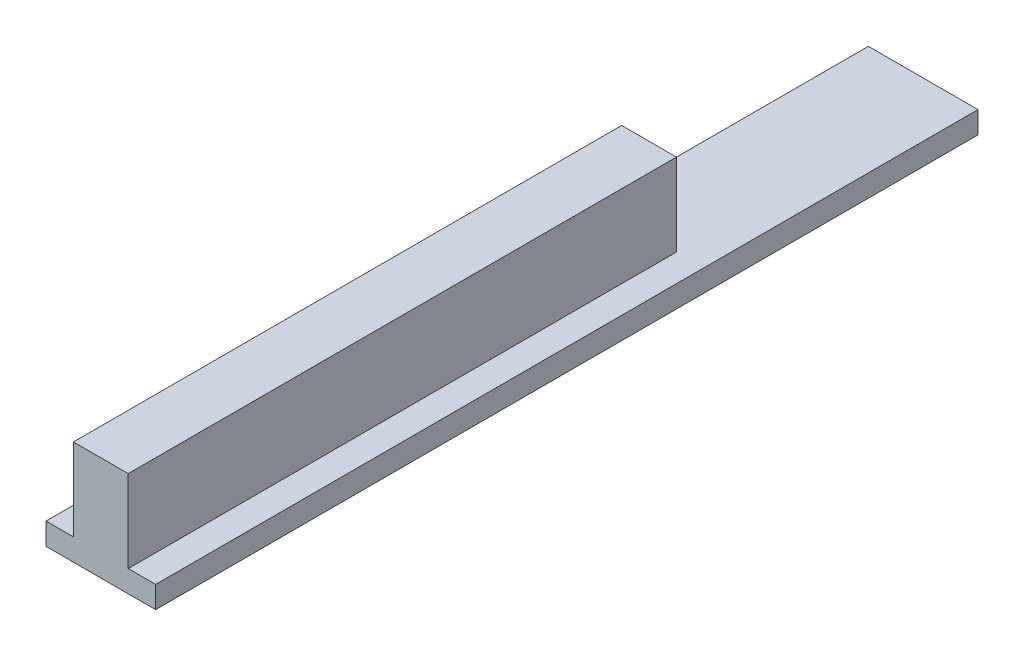
ISO-10303-21;
HEADER;
FILE_DESCRIPTION(('STEP AP214'),'2;1');
FILE_NAME('part.step','',(''),(''),'','','');
FILE_SCHEMA(('AUTOMOTIVE_DESIGN { 1 0 10303 214 1 1 1 1 }'));
ENDSEC;
DATA;
#1=APPLICATION_CONTEXT('core data for automotive mechanical design processes');
#2=APPLICATION_PROTOCOL_DEFINITION('international standard','automotive_design',2000,#1);
#3=PRODUCT_CONTEXT('',#1,'mechanical');
#4=PRODUCT('Part','Part','',(#3));
#5=PRODUCT_RELATED_PRODUCT_CATEGORY('part','',(#4));
#6=PRODUCT_DEFINITION_FORMATION('','',#4);
#7=PRODUCT_DEFINITION_CONTEXT('part definition',#1,'design');
#8=PRODUCT_DEFINITION('design','',#6,#7);
#9=PRODUCT_DEFINITION_SHAPE('','',#8);
#10=(LENGTH_UNIT() NAMED_UNIT(*) SI_UNIT(.MILLI.,.METRE.));
#11=(NAMED_UNIT(*) PLANE_ANGLE_UNIT() SI_UNIT($,.RADIAN.));
#12=(NAMED_UNIT(*) SI_UNIT($,.STERADIAN.) SOLID_ANGLE_UNIT());
#13=UNCERTAINTY_MEASURE_WITH_UNIT(LENGTH_MEASURE(1.E-05),#10,'distance_accuracy_value','');
#14=(GEOMETRIC_REPRESENTATION_CONTEXT(3) GLOBAL_UNCERTAINTY_ASSIGNED_CONTEXT((#13)) GLOBAL_UNIT_ASSIGNED_CONTEXT((#10,
#11,#12)) REPRESENTATION_CONTEXT('',''));
#15=CARTESIAN_POINT('',(0.,0.,0.));
#16=DIRECTION('',(0.,0.,1.));
#17=DIRECTION('',(1.,0.,0.));
#18=AXIS2_PLACEMENT_3D('',#15,#16,#17);
#19=CARTESIAN_POINT('',(5.00000000000006,0.,100.));
#20=DIRECTION('',(-1.,0.,0.));
#21=DIRECTION('',(0.,-1.,0.));
#22=AXIS2_PLACEMENT_3D('',#19,#20,#21);
#23=PLANE('',#22);
#24=DIRECTION('',(0.,1.,0.));
#25=VECTOR('',#24,1.);
#26=CARTESIAN_POINT('',(5.00000000000006,0.,0.));
#27=LINE('',#26,#25);
#28=CARTESIAN_POINT('',(5.00000000000006,4.,0.));
#29=VERTEX_POINT('',#28);
#30=CARTESIAN_POINT('',(5.00000000000006,19.,0.));
#31=VERTEX_POINT('',#30);
#32=EDGE_CURVE('E70',#29,#31,#27,.T.);
#33=ORIENTED_EDGE('',*,*,#32,.T.);
#34=DIRECTION('',(0.,0.,-1.));
#35=VECTOR('',#34,1.);
#36=CARTESIAN_POINT('',(5.00000000000006,19.,100.));
#37=LINE('',#36,#35);
#38=CARTESIAN_POINT('',(5.00000000000006,19.,100.));
#39=VERTEX_POINT('',#38);
#40=EDGE_CURVE('E158',#39,#31,#37,.T.);
#41=ORIENTED_EDGE('',*,*,#40,.F.);
#42=DIRECTION('',(0.,1.,0.));
#43=VECTOR('',#42,1.);
#44=CARTESIAN_POINT('',(5.00000000000006,0.,100.));
#45=LINE('',#44,#43);
#46=CARTESIAN_POINT('',(5.00000000000006,4.,100.));
#47=VERTEX_POINT('',#46);
#48=EDGE_CURVE('E165',#47,#39,#45,.T.);
#49=ORIENTED_EDGE('',*,*,#48,.F.);
#50=DIRECTION('',(0.,0.,-1.));
#51=VECTOR('',#50,1.);
#52=CARTESIAN_POINT('',(5.00000000000006,4.,100.));
#53=LINE('',#52,#51);
#54=EDGE_CURVE('E42',#47,#29,#53,.T.);
#55=ORIENTED_EDGE('',*,*,#54,.T.);
#56=EDGE_LOOP('',(#33,#41,#49,#55));
#57=FACE_BOUND('',#56,.T.);
#58=ADVANCED_FACE('F39',(#57),#23,.F.);
#59=CARTESIAN_POINT('',(0.,19.,100.));
#60=DIRECTION('',(0.,-1.,0.));
#61=DIRECTION('',(1.,0.,0.));
#62=AXIS2_PLACEMENT_3D('',#59,#60,#61);
#63=PLANE('',#62);
#64=DIRECTION('',(-1.,0.,0.));
#65=VECTOR('',#64,1.);
#66=CARTESIAN_POINT('',(0.,19.,0.));
#67=LINE('',#66,#65);
#68=CARTESIAN_POINT('',(-5.0000000000001,19.,0.));
#69=VERTEX_POINT('',#68);
#70=EDGE_CURVE('E137',#31,#69,#67,.T.);
#71=ORIENTED_EDGE('',*,*,#70,.T.);
#72=DIRECTION('',(0.,0.,-1.));
#73=VECTOR('',#72,1.);
#74=CARTESIAN_POINT('',(-5.0000000000001,19.,100.));
#75=LINE('',#74,#73);
#76=CARTESIAN_POINT('',(-5.0000000000001,19.,100.));
#77=VERTEX_POINT('',#76);
#78=EDGE_CURVE('E156',#77,#69,#75,.T.);
#79=ORIENTED_EDGE('',*,*,#78,.F.);
#80=DIRECTION('',(-1.,0.,0.));
#81=VECTOR('',#80,1.);
#82=CARTESIAN_POINT('',(0.,19.,100.));
#83=LINE('',#82,#81);
#84=EDGE_CURVE('E174',#39,#77,#83,.T.);
#85=ORIENTED_EDGE('',*,*,#84,.F.);
#86=ORIENTED_EDGE('',*,*,#40,.T.);
#87=EDGE_LOOP('',(#71,#79,#85,#86));
#88=FACE_BOUND('',#87,.T.);
#89=ADVANCED_FACE('F172',(#88),#63,.F.);
#90=CARTESIAN_POINT('',(-5.00000000000003,0.,100.));
#91=DIRECTION('',(-1.,0.,0.));
#92=DIRECTION('',(0.,-1.,0.));
#93=AXIS2_PLACEMENT_3D('',#90,#91,#92);
#94=PLANE('',#93);
#95=DIRECTION('',(0.,1.,0.));
#96=VECTOR('',#95,1.);
#97=CARTESIAN_POINT('',(-5.00000000000003,0.,0.));
#98=LINE('',#97,#96);
#99=CARTESIAN_POINT('',(-5.00000000000006,4.,0.));
#100=VERTEX_POINT('',#99);
#101=EDGE_CURVE('E142',#100,#69,#98,.T.);
#102=ORIENTED_EDGE('',*,*,#101,.F.);
#103=DIRECTION('',(0.,0.,-1.));
#104=VECTOR('',#103,1.);
#105=CARTESIAN_POINT('',(-5.00000000000006,4.,100.));
#106=LINE('',#105,#104);
#107=CARTESIAN_POINT('',(-5.00000000000006,4.,100.));
#108=VERTEX_POINT('',#107);
#109=EDGE_CURVE('E153',#108,#100,#106,.T.);
#110=ORIENTED_EDGE('',*,*,#109,.F.);
#111=DIRECTION('',(0.,1.,0.));
#112=VECTOR('',#111,1.);
#113=CARTESIAN_POINT('',(-5.00000000000003,0.,100.));
#114=LINE('',#113,#112);
#115=EDGE_CURVE('E176',#108,#77,#114,.T.);
#116=ORIENTED_EDGE('',*,*,#115,.T.);
#117=ORIENTED_EDGE('',*,*,#78,.T.);
#118=EDGE_LOOP('',(#102,#110,#116,#117));
#119=FACE_BOUND('',#118,.T.);
#120=ADVANCED_FACE('F177',(#119),#94,.T.);
#121=CARTESIAN_POINT('',(0.,4.,100.));
#122=DIRECTION('',(0.,-1.,0.));
#123=DIRECTION('',(0.,0.,-1.));
#124=AXIS2_PLACEMENT_3D('',#121,#122,#123);
#125=PLANE('',#124);
#126=ORIENTED_EDGE('',*,*,#109,.T.);
#127=DIRECTION('',(-1.,0.,0.));
#128=VECTOR('',#127,1.);
#129=CARTESIAN_POINT('',(0.,4.,0.));
#130=LINE('',#129,#128);
#131=EDGE_CURVE('E11',#29,#100,#130,.T.);
#132=ORIENTED_EDGE('',*,*,#131,.F.);
#133=ORIENTED_EDGE('',*,*,#54,.F.);
#134=DIRECTION('',(-1.,0.,0.));
#135=VECTOR('',#134,1.);
#136=CARTESIAN_POINT('',(0.,4.,100.));
#137=LINE('',#136,#135);
#138=CARTESIAN_POINT('',(10.0000000000001,4.,100.));
#139=VERTEX_POINT('',#138);
#140=EDGE_CURVE('E145',#139,#47,#137,.T.);
#141=ORIENTED_EDGE('',*,*,#140,.F.);
#142=DIRECTION('',(0.,0.,-1.));
#143=VECTOR('',#142,1.);
#144=CARTESIAN_POINT('',(10.0000000000001,4.,100.));
#145=LINE('',#144,#143);
#146=CARTESIAN_POINT('',(10.0000000000001,4.,-50.));
#147=VERTEX_POINT('',#146);
#148=EDGE_CURVE('E131',#139,#147,#145,.T.);
#149=ORIENTED_EDGE('',*,*,#148,.T.);
#150=DIRECTION('',(-1.,0.,0.));
#151=VECTOR('',#150,1.);
#152=CARTESIAN_POINT('',(0.,4.,-50.));
#153=LINE('',#152,#151);
#154=CARTESIAN_POINT('',(-10.0000000000001,4.,-50.));
#155=VERTEX_POINT('',#154);
#156=EDGE_CURVE('E195',#147,#155,#153,.T.);
#157=ORIENTED_EDGE('',*,*,#156,.T.);
#158=DIRECTION('',(0.,0.,-1.));
#159=VECTOR('',#158,1.);
#160=CARTESIAN_POINT('',(-10.0000000000001,4.,100.));
#161=LINE('',#160,#159);
#162=CARTESIAN_POINT('',(-10.0000000000001,4.,100.));
#163=VERTEX_POINT('',#162);
#164=EDGE_CURVE('E115',#163,#155,#161,.T.);
#165=ORIENTED_EDGE('',*,*,#164,.F.);
#166=EDGE_CURVE('E122',#108,#163,#137,.T.);
#167=ORIENTED_EDGE('',*,*,#166,.F.);
#168=EDGE_LOOP('',(#126,#132,#133,#141,#149,#157,#165,#167));
#169=FACE_BOUND('',#168,.T.);
#170=ADVANCED_FACE('F168',(#169),#125,.F.);
#171=CARTESIAN_POINT('',(-10.,-1.64798730217797E-13,100.));
#172=DIRECTION('',(-1.,0.,0.));
#173=DIRECTION('',(0.,-1.,0.));
#174=AXIS2_PLACEMENT_3D('',#171,#172,#173);
#175=PLANE('',#174);
#176=ORIENTED_EDGE('',*,*,#164,.T.);
#177=DIRECTION('',(0.,1.,0.));
#178=VECTOR('',#177,1.);
#179=CARTESIAN_POINT('',(-10.,-1.64798730217797E-13,-50.));
#180=LINE('',#179,#178);
#181=CARTESIAN_POINT('',(-10.,0.,-50.));
#182=VERTEX_POINT('',#181);
#183=EDGE_CURVE('E109',#182,#155,#180,.T.);
#184=ORIENTED_EDGE('',*,*,#183,.F.);
#185=DIRECTION('',(0.,0.,-1.));
#186=VECTOR('',#185,1.);
#187=CARTESIAN_POINT('',(-10.,0.,100.));
#188=LINE('',#187,#186);
#189=CARTESIAN_POINT('',(-10.,0.,100.));
#190=VERTEX_POINT('',#189);
#191=EDGE_CURVE('E102',#190,#182,#188,.T.);
#192=ORIENTED_EDGE('',*,*,#191,.F.);
#193=DIRECTION('',(0.,1.,0.));
#194=VECTOR('',#193,1.);
#195=CARTESIAN_POINT('',(-10.,-1.64798730217797E-13,100.));
#196=LINE('',#195,#194);
#197=EDGE_CURVE('E106',#190,#163,#196,.T.);
#198=ORIENTED_EDGE('',*,*,#197,.T.);
#199=EDGE_LOOP('',(#176,#184,#192,#198));
#200=FACE_BOUND('',#199,.T.);
#201=ADVANCED_FACE('F105',(#200),#175,.T.);
#202=CARTESIAN_POINT('',(0.,0.,100.));
#203=DIRECTION('',(0.,-1.,0.));
#204=DIRECTION('',(1.,0.,0.));
#205=AXIS2_PLACEMENT_3D('',#202,#203,#204);
#206=PLANE('',#205);
#207=ORIENTED_EDGE('',*,*,#191,.T.);
#208=DIRECTION('',(-1.,0.,0.));
#209=VECTOR('',#208,1.);
#210=CARTESIAN_POINT('',(0.,0.,-50.));
#211=LINE('',#210,#209);
#212=CARTESIAN_POINT('',(10.0000000000001,0.,-50.));
#213=VERTEX_POINT('',#212);
#214=EDGE_CURVE('E190',#213,#182,#211,.T.);
#215=ORIENTED_EDGE('',*,*,#214,.F.);
#216=DIRECTION('',(0.,0.,-1.));
#217=VECTOR('',#216,1.);
#218=CARTESIAN_POINT('',(10.0000000000001,0.,100.));
#219=LINE('',#218,#217);
#220=CARTESIAN_POINT('',(10.0000000000001,0.,100.));
#221=VERTEX_POINT('',#220);
#222=EDGE_CURVE('E116',#221,#213,#219,.T.);
#223=ORIENTED_EDGE('',*,*,#222,.F.);
#224=DIRECTION('',(-1.,0.,0.));
#225=VECTOR('',#224,1.);
#226=CARTESIAN_POINT('',(0.,0.,100.));
#227=LINE('',#226,#225);
#228=EDGE_CURVE('E119',#221,#190,#227,.T.);
#229=ORIENTED_EDGE('',*,*,#228,.T.);
#230=EDGE_LOOP('',(#207,#215,#223,#229));
#231=FACE_BOUND('',#230,.T.);
#232=ADVANCED_FACE('F126',(#231),#206,.T.);
#233=CARTESIAN_POINT('',(10.0000000000001,1.64798730217802E-13,100.));
#234=DIRECTION('',(-1.,0.,0.));
#235=DIRECTION('',(0.,-1.,0.));
#236=AXIS2_PLACEMENT_3D('',#233,#234,#235);
#237=PLANE('',#236);
#238=ORIENTED_EDGE('',*,*,#222,.T.);
#239=DIRECTION('',(0.,1.,0.));
#240=VECTOR('',#239,1.);
#241=CARTESIAN_POINT('',(10.0000000000001,1.64798730217802E-13,-50.));
#242=LINE('',#241,#240);
#243=EDGE_CURVE('E138',#213,#147,#242,.T.);
#244=ORIENTED_EDGE('',*,*,#243,.T.);
#245=ORIENTED_EDGE('',*,*,#148,.F.);
#246=DIRECTION('',(0.,1.,0.));
#247=VECTOR('',#246,1.);
#248=CARTESIAN_POINT('',(10.0000000000001,1.64798730217802E-13,100.));
#249=LINE('',#248,#247);
#250=EDGE_CURVE('E57',#221,#139,#249,.T.);
#251=ORIENTED_EDGE('',*,*,#250,.F.);
#252=EDGE_LOOP('',(#238,#244,#245,#251));
#253=FACE_BOUND('',#252,.T.);
#254=ADVANCED_FACE('F206',(#253),#237,.F.);
#255=CARTESIAN_POINT('',(0.,0.,100.));
#256=DIRECTION('',(0.,0.,1.));
#257=DIRECTION('',(1.,0.,0.));
#258=AXIS2_PLACEMENT_3D('',#255,#256,#257);
#259=PLANE('',#258);
#260=ORIENTED_EDGE('',*,*,#140,.T.);
#261=ORIENTED_EDGE('',*,*,#48,.T.);
#262=ORIENTED_EDGE('',*,*,#84,.T.);
#263=ORIENTED_EDGE('',*,*,#115,.F.);
#264=ORIENTED_EDGE('',*,*,#166,.T.);
#265=ORIENTED_EDGE('',*,*,#197,.F.);
#266=ORIENTED_EDGE('',*,*,#228,.F.);
#267=ORIENTED_EDGE('',*,*,#250,.T.);
#268=EDGE_LOOP('',(#260,#261,#262,#263,#264,#265,#266,#267));
#269=FACE_BOUND('',#268,.T.);
#270=ADVANCED_FACE('F118',(#269),#259,.T.);
#271=CARTESIAN_POINT('',(0.,0.,0.));
#272=DIRECTION('',(0.,0.,1.));
#273=DIRECTION('',(1.,0.,0.));
#274=AXIS2_PLACEMENT_3D('',#271,#272,#273);
#275=PLANE('',#274);
#276=ORIENTED_EDGE('',*,*,#32,.F.);
#277=ORIENTED_EDGE('',*,*,#131,.T.);
#278=ORIENTED_EDGE('',*,*,#101,.T.);
#279=ORIENTED_EDGE('',*,*,#70,.F.);
#280=EDGE_LOOP('',(#276,#277,#278,#279));
#281=FACE_BOUND('',#280,.T.);
#282=ADVANCED_FACE('F170',(#281),#275,.F.);
#283=CARTESIAN_POINT('',(0.,0.,-50.));
#284=DIRECTION('',(0.,0.,1.));
#285=DIRECTION('',(1.,0.,0.));
#286=AXIS2_PLACEMENT_3D('',#283,#284,#285);
#287=PLANE('',#286);
#288=ORIENTED_EDGE('',*,*,#156,.F.);
#289=ORIENTED_EDGE('',*,*,#243,.F.);
#290=ORIENTED_EDGE('',*,*,#214,.T.);
#291=ORIENTED_EDGE('',*,*,#183,.T.);
#292=EDGE_LOOP('',(#288,#289,#290,#291));
#293=FACE_BOUND('',#292,.T.);
#294=ADVANCED_FACE('F203',(#293),#287,.F.);
#295=CLOSED_SHELL('',(#58,#89,#120,#170,#201,#232,#254,#270,#282,#294));
#296=MANIFOLD_SOLID_BREP('B2',#295);
#297=ADVANCED_BREP_SHAPE_REPRESENTATION('',(#18,#296),#14);
#298=SHAPE_DEFINITION_REPRESENTATION(#9,#297);
ENDSEC;
END-ISO-10303-21;
